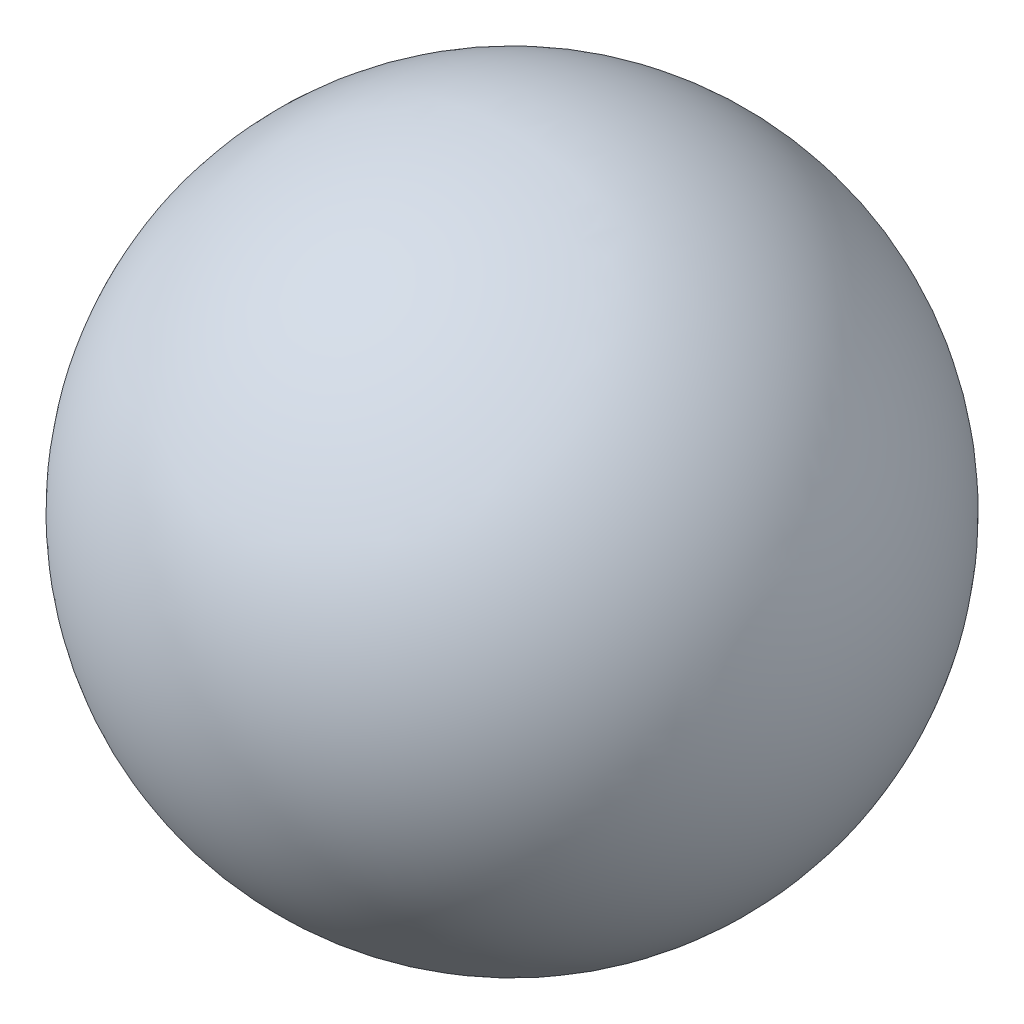
ISO-10303-21;
HEADER;
FILE_DESCRIPTION(('STEP AP214'),'2;1');
FILE_NAME('part.step','',(''),(''),'','','');
FILE_SCHEMA(('AUTOMOTIVE_DESIGN { 1 0 10303 214 1 1 1 1 }'));
ENDSEC;
DATA;
#1=APPLICATION_CONTEXT('core data for automotive mechanical design processes');
#2=APPLICATION_PROTOCOL_DEFINITION('international standard','automotive_design',2000,#1);
#3=PRODUCT_CONTEXT('',#1,'mechanical');
#4=PRODUCT('Part','Part','',(#3));
#5=PRODUCT_RELATED_PRODUCT_CATEGORY('part','',(#4));
#6=PRODUCT_DEFINITION_FORMATION('','',#4);
#7=PRODUCT_DEFINITION_CONTEXT('part definition',#1,'design');
#8=PRODUCT_DEFINITION('design','',#6,#7);
#9=PRODUCT_DEFINITION_SHAPE('','',#8);
#10=(LENGTH_UNIT() NAMED_UNIT(*) SI_UNIT(.MILLI.,.METRE.));
#11=(NAMED_UNIT(*) PLANE_ANGLE_UNIT() SI_UNIT($,.RADIAN.));
#12=(NAMED_UNIT(*) SI_UNIT($,.STERADIAN.) SOLID_ANGLE_UNIT());
#13=UNCERTAINTY_MEASURE_WITH_UNIT(LENGTH_MEASURE(1.E-05),#10,'distance_accuracy_value','');
#14=(GEOMETRIC_REPRESENTATION_CONTEXT(3) GLOBAL_UNCERTAINTY_ASSIGNED_CONTEXT((#13)) GLOBAL_UNIT_ASSIGNED_CONTEXT((#10,
#11,#12)) REPRESENTATION_CONTEXT('',''));
#15=CARTESIAN_POINT('',(0.,0.,0.));
#16=DIRECTION('',(0.,0.,1.));
#17=DIRECTION('',(1.,0.,0.));
#18=AXIS2_PLACEMENT_3D('',#15,#16,#17);
#19=CARTESIAN_POINT('',(-6.06520907209285,8.34804411070658,0.));
#20=DIRECTION('',(1.,0.,0.));
#21=DIRECTION('',(0.,1.,0.));
#22=AXIS2_PLACEMENT_3D('',#19,#20,#21);
#23=SPHERICAL_SURFACE('',#22,1.71627890103155);
#24=CARTESIAN_POINT('',(-4.3489301710613,8.34804411070658,0.));
#25=VERTEX_POINT('',#24);
#26=VERTEX_LOOP('',#25);
#27=FACE_BOUND('',#26,.T.);
#28=CARTESIAN_POINT('',(-7.7814879731244,8.34804411070658,0.));
#29=VERTEX_POINT('',#28);
#30=VERTEX_LOOP('',#29);
#31=FACE_BOUND('',#30,.T.);
#32=ADVANCED_FACE('F16',(#27,#31),#23,.T.);
#33=CLOSED_SHELL('',(#32));
#34=MANIFOLD_SOLID_BREP('B1',#33);
#35=ADVANCED_BREP_SHAPE_REPRESENTATION('',(#18,#34),#14);
#36=SHAPE_DEFINITION_REPRESENTATION(#9,#35);
ENDSEC;
END-ISO-10303-21;
